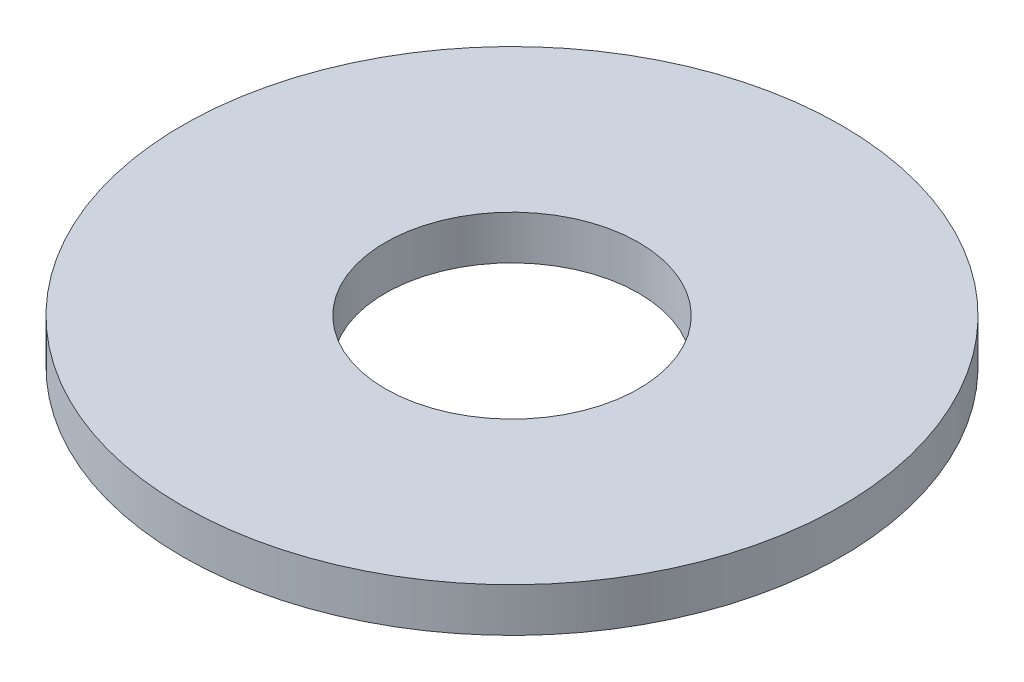
ISO-10303-21;
HEADER;
FILE_DESCRIPTION(('STEP AP214'),'2;1');
FILE_NAME('part.step','',(''),(''),'','','');
FILE_SCHEMA(('AUTOMOTIVE_DESIGN { 1 0 10303 214 1 1 1 1 }'));
ENDSEC;
DATA;
#1=APPLICATION_CONTEXT('core data for automotive mechanical design processes');
#2=APPLICATION_PROTOCOL_DEFINITION('international standard','automotive_design',2000,#1);
#3=PRODUCT_CONTEXT('',#1,'mechanical');
#4=PRODUCT('Part','Part','',(#3));
#5=PRODUCT_RELATED_PRODUCT_CATEGORY('part','',(#4));
#6=PRODUCT_DEFINITION_FORMATION('','',#4);
#7=PRODUCT_DEFINITION_CONTEXT('part definition',#1,'design');
#8=PRODUCT_DEFINITION('design','',#6,#7);
#9=PRODUCT_DEFINITION_SHAPE('','',#8);
#10=(LENGTH_UNIT() NAMED_UNIT(*) SI_UNIT(.MILLI.,.METRE.));
#11=(NAMED_UNIT(*) PLANE_ANGLE_UNIT() SI_UNIT($,.RADIAN.));
#12=(NAMED_UNIT(*) SI_UNIT($,.STERADIAN.) SOLID_ANGLE_UNIT());
#13=UNCERTAINTY_MEASURE_WITH_UNIT(LENGTH_MEASURE(1.E-05),#10,'distance_accuracy_value','');
#14=(GEOMETRIC_REPRESENTATION_CONTEXT(3) GLOBAL_UNCERTAINTY_ASSIGNED_CONTEXT((#13)) GLOBAL_UNIT_ASSIGNED_CONTEXT((#10,
#11,#12)) REPRESENTATION_CONTEXT('',''));
#15=CARTESIAN_POINT('',(0.,0.,0.));
#16=DIRECTION('',(0.,0.,1.));
#17=DIRECTION('',(1.,0.,0.));
#18=AXIS2_PLACEMENT_3D('',#15,#16,#17);
#19=CARTESIAN_POINT('',(0.,13.,0.));
#20=DIRECTION('',(0.,-1.,0.));
#21=DIRECTION('',(0.,0.,-1.));
#22=AXIS2_PLACEMENT_3D('',#19,#20,#21);
#23=CYLINDRICAL_SURFACE('',#22,97.5);
#24=CARTESIAN_POINT('',(0.,13.,0.));
#25=DIRECTION('',(0.,1.,0.));
#26=DIRECTION('',(0.,0.,1.));
#27=AXIS2_PLACEMENT_3D('',#24,#25,#26);
#28=CIRCLE('',#27,97.5);
#29=CARTESIAN_POINT('',(0.,13.,-97.5));
#30=VERTEX_POINT('',#29);
#31=EDGE_CURVE('E10',#30,#30,#28,.T.);
#32=CARTESIAN_POINT('',(0.,0.,0.));
#33=DIRECTION('',(0.,1.,0.));
#34=DIRECTION('',(0.,0.,1.));
#35=AXIS2_PLACEMENT_3D('',#32,#33,#34);
#36=CIRCLE('',#35,97.5);
#37=CARTESIAN_POINT('',(0.,0.,-97.5));
#38=VERTEX_POINT('',#37);
#39=EDGE_CURVE('E37',#38,#38,#36,.T.);
#40=CARTESIAN_POINT('',(0.,13.,-97.5));
#41=CARTESIAN_POINT('',(0.,12.8645833333333,-97.5));
#42=CARTESIAN_POINT('',(0.,12.7291666666667,-97.5));
#43=CARTESIAN_POINT('',(0.,12.4583333333333,-97.5));
#44=CARTESIAN_POINT('',(0.,12.3229166666667,-97.5));
#45=CARTESIAN_POINT('',(0.,12.0520833333333,-97.5));
#46=CARTESIAN_POINT('',(0.,11.9166666666667,-97.5));
#47=CARTESIAN_POINT('',(0.,11.6458333333333,-97.5));
#48=CARTESIAN_POINT('',(0.,11.5104166666667,-97.5));
#49=CARTESIAN_POINT('',(0.,11.2395833333333,-97.5));
#50=CARTESIAN_POINT('',(0.,11.1041666666667,-97.5));
#51=CARTESIAN_POINT('',(0.,10.8333333333333,-97.5));
#52=CARTESIAN_POINT('',(0.,10.6979166666667,-97.5));
#53=CARTESIAN_POINT('',(0.,10.4270833333333,-97.5));
#54=CARTESIAN_POINT('',(0.,10.2916666666667,-97.5));
#55=CARTESIAN_POINT('',(0.,10.0208333333333,-97.5));
#56=CARTESIAN_POINT('',(0.,9.88541666666667,-97.5));
#57=CARTESIAN_POINT('',(0.,9.61458333333333,-97.5));
#58=CARTESIAN_POINT('',(0.,9.47916666666667,-97.5));
#59=CARTESIAN_POINT('',(0.,9.20833333333333,-97.5));
#60=CARTESIAN_POINT('',(0.,9.07291666666667,-97.5));
#61=CARTESIAN_POINT('',(0.,8.80208333333333,-97.5));
#62=CARTESIAN_POINT('',(0.,8.66666666666667,-97.5));
#63=CARTESIAN_POINT('',(0.,8.39583333333333,-97.5));
#64=CARTESIAN_POINT('',(0.,8.26041666666667,-97.5));
#65=CARTESIAN_POINT('',(0.,7.98958333333333,-97.5));
#66=CARTESIAN_POINT('',(0.,7.85416666666667,-97.5));
#67=CARTESIAN_POINT('',(0.,7.58333333333333,-97.5));
#68=CARTESIAN_POINT('',(0.,7.44791666666667,-97.5));
#69=CARTESIAN_POINT('',(0.,7.17708333333333,-97.5));
#70=CARTESIAN_POINT('',(0.,7.04166666666667,-97.5));
#71=CARTESIAN_POINT('',(0.,6.77083333333333,-97.5));
#72=CARTESIAN_POINT('',(0.,6.63541666666667,-97.5));
#73=CARTESIAN_POINT('',(0.,6.36458333333333,-97.5));
#74=CARTESIAN_POINT('',(0.,6.22916666666667,-97.5));
#75=CARTESIAN_POINT('',(0.,5.95833333333333,-97.5));
#76=CARTESIAN_POINT('',(0.,5.82291666666667,-97.5));
#77=CARTESIAN_POINT('',(0.,5.55208333333333,-97.5));
#78=CARTESIAN_POINT('',(0.,5.41666666666667,-97.5));
#79=CARTESIAN_POINT('',(0.,5.14583333333333,-97.5));
#80=CARTESIAN_POINT('',(0.,5.01041666666667,-97.5));
#81=CARTESIAN_POINT('',(0.,4.73958333333333,-97.5));
#82=CARTESIAN_POINT('',(0.,4.60416666666667,-97.5));
#83=CARTESIAN_POINT('',(0.,4.33333333333333,-97.5));
#84=CARTESIAN_POINT('',(0.,4.19791666666667,-97.5));
#85=CARTESIAN_POINT('',(0.,3.92708333333333,-97.5));
#86=CARTESIAN_POINT('',(0.,3.79166666666667,-97.5));
#87=CARTESIAN_POINT('',(0.,3.52083333333333,-97.5));
#88=CARTESIAN_POINT('',(0.,3.38541666666667,-97.5));
#89=CARTESIAN_POINT('',(0.,3.11458333333333,-97.5));
#90=CARTESIAN_POINT('',(0.,2.97916666666667,-97.5));
#91=CARTESIAN_POINT('',(0.,2.70833333333333,-97.5));
#92=CARTESIAN_POINT('',(0.,2.57291666666667,-97.5));
#93=CARTESIAN_POINT('',(0.,2.30208333333333,-97.5));
#94=CARTESIAN_POINT('',(0.,2.16666666666667,-97.5));
#95=CARTESIAN_POINT('',(0.,1.89583333333333,-97.5));
#96=CARTESIAN_POINT('',(0.,1.76041666666667,-97.5));
#97=CARTESIAN_POINT('',(0.,1.48958333333333,-97.5));
#98=CARTESIAN_POINT('',(0.,1.35416666666667,-97.5));
#99=CARTESIAN_POINT('',(0.,1.08333333333333,-97.5));
#100=CARTESIAN_POINT('',(0.,0.947916666666667,-97.5));
#101=CARTESIAN_POINT('',(0.,0.677083333333334,-97.5));
#102=CARTESIAN_POINT('',(0.,0.541666666666667,-97.5));
#103=CARTESIAN_POINT('',(0.,0.270833333333334,-97.5));
#104=CARTESIAN_POINT('',(0.,0.135416666666667,-97.5));
#105=CARTESIAN_POINT('',(0.,0.,-97.5));
#106=B_SPLINE_CURVE_WITH_KNOTS('',3,(#40,#41,#42,#43,#44,#45,#46,#47,#48,#49,#50,#51,#52,#53,
#54,#55,#56,#57,#58,#59,#60,#61,#62,#63,#64,#65,#66,#67,#68,#69,#70,#71,#72,#73,#74,#75,#76,#77,
#78,#79,#80,#81,#82,#83,#84,#85,#86,#87,#88,#89,#90,#91,#92,#93,#94,#95,#96,#97,#98,#99,#100,
#101,#102,#103,#104,#105),.UNSPECIFIED.,.F.,.F.,(4,2,2,2,2,2,2,2,2,2,2,2,2,2,2,2,2,2,2,2,2,2,2,
2,2,2,2,2,2,2,2,2,4),(0.,0.406249999999999,0.812499999999999,1.21875,1.625,2.03125,2.4375,
2.84375,3.25,3.65625,4.0625,4.46875,4.875,5.28125,5.6875,6.09375,6.5,6.90625,7.3125,7.71875,
8.125,8.53125,8.9375,9.34375,9.75,10.15625,10.5625,10.96875,11.375,11.78125,12.1875,12.59375,
13.),.UNSPECIFIED.);
#107=EDGE_CURVE('BSEAM40',#30,#38,#106,.T.);
#108=ORIENTED_EDGE('',*,*,#31,.F.);
#109=ORIENTED_EDGE('',*,*,#39,.T.);
#110=ORIENTED_EDGE('',*,*,#107,.T.);
#111=ORIENTED_EDGE('',*,*,#107,.F.);
#112=EDGE_LOOP('',(#108,#110,#109,#111));
#113=FACE_BOUND('',#112,.T.);
#114=ADVANCED_FACE('F40',(#113),#23,.T.);
#115=CARTESIAN_POINT('',(0.,13.,0.));
#116=DIRECTION('',(0.,1.,0.));
#117=DIRECTION('',(0.,0.,1.));
#118=AXIS2_PLACEMENT_3D('',#115,#116,#117);
#119=PLANE('',#118);
#120=CARTESIAN_POINT('',(0.,13.,0.));
#121=DIRECTION('',(0.,1.,0.));
#122=DIRECTION('',(0.,0.,1.));
#123=AXIS2_PLACEMENT_3D('',#120,#121,#122);
#124=CIRCLE('',#123,37.5);
#125=CARTESIAN_POINT('',(0.,13.,-37.5));
#126=VERTEX_POINT('',#125);
#127=EDGE_CURVE('E50',#126,#126,#124,.T.);
#128=ORIENTED_EDGE('',*,*,#127,.F.);
#129=EDGE_LOOP('',(#128));
#130=FACE_BOUND('',#129,.T.);
#131=ORIENTED_EDGE('',*,*,#31,.T.);
#132=EDGE_LOOP('',(#131));
#133=FACE_BOUND('',#132,.T.);
#134=ADVANCED_FACE('F59',(#130,#133),#119,.T.);
#135=CARTESIAN_POINT('',(0.,0.,0.));
#136=DIRECTION('',(0.,1.,0.));
#137=DIRECTION('',(0.,0.,1.));
#138=AXIS2_PLACEMENT_3D('',#135,#136,#137);
#139=PLANE('',#138);
#140=CARTESIAN_POINT('',(0.,0.,0.));
#141=DIRECTION('',(0.,1.,0.));
#142=DIRECTION('',(0.,0.,1.));
#143=AXIS2_PLACEMENT_3D('',#140,#141,#142);
#144=CIRCLE('',#143,37.5);
#145=CARTESIAN_POINT('',(0.,0.,-37.5));
#146=VERTEX_POINT('',#145);
#147=EDGE_CURVE('E47',#146,#146,#144,.T.);
#148=ORIENTED_EDGE('',*,*,#147,.T.);
#149=EDGE_LOOP('',(#148));
#150=FACE_BOUND('',#149,.T.);
#151=ORIENTED_EDGE('',*,*,#39,.F.);
#152=EDGE_LOOP('',(#151));
#153=FACE_BOUND('',#152,.T.);
#154=ADVANCED_FACE('F58',(#150,#153),#139,.F.);
#155=CARTESIAN_POINT('',(0.,13.,0.));
#156=DIRECTION('',(0.,-1.,0.));
#157=DIRECTION('',(0.,0.,-1.));
#158=AXIS2_PLACEMENT_3D('',#155,#156,#157);
#159=CYLINDRICAL_SURFACE('',#158,37.5);
#160=CARTESIAN_POINT('',(0.,13.,-37.5));
#161=CARTESIAN_POINT('',(0.,12.8645833333333,-37.5));
#162=CARTESIAN_POINT('',(0.,12.7291666666667,-37.5));
#163=CARTESIAN_POINT('',(0.,12.4583333333333,-37.5));
#164=CARTESIAN_POINT('',(0.,12.3229166666667,-37.5));
#165=CARTESIAN_POINT('',(0.,12.0520833333333,-37.5));
#166=CARTESIAN_POINT('',(0.,11.9166666666667,-37.5));
#167=CARTESIAN_POINT('',(0.,11.6458333333333,-37.5));
#168=CARTESIAN_POINT('',(0.,11.5104166666667,-37.5));
#169=CARTESIAN_POINT('',(0.,11.2395833333333,-37.5));
#170=CARTESIAN_POINT('',(0.,11.1041666666667,-37.5));
#171=CARTESIAN_POINT('',(0.,10.8333333333333,-37.5));
#172=CARTESIAN_POINT('',(0.,10.6979166666667,-37.5));
#173=CARTESIAN_POINT('',(0.,10.4270833333333,-37.5));
#174=CARTESIAN_POINT('',(0.,10.2916666666667,-37.5));
#175=CARTESIAN_POINT('',(0.,10.0208333333333,-37.5));
#176=CARTESIAN_POINT('',(0.,9.88541666666667,-37.5));
#177=CARTESIAN_POINT('',(0.,9.61458333333333,-37.5));
#178=CARTESIAN_POINT('',(0.,9.47916666666667,-37.5));
#179=CARTESIAN_POINT('',(0.,9.20833333333333,-37.5));
#180=CARTESIAN_POINT('',(0.,9.07291666666666,-37.5));
#181=CARTESIAN_POINT('',(0.,8.80208333333333,-37.5));
#182=CARTESIAN_POINT('',(0.,8.66666666666667,-37.5));
#183=CARTESIAN_POINT('',(0.,8.39583333333333,-37.5));
#184=CARTESIAN_POINT('',(0.,8.26041666666667,-37.5));
#185=CARTESIAN_POINT('',(0.,7.98958333333333,-37.5));
#186=CARTESIAN_POINT('',(0.,7.85416666666667,-37.5));
#187=CARTESIAN_POINT('',(0.,7.58333333333333,-37.5));
#188=CARTESIAN_POINT('',(0.,7.44791666666667,-37.5));
#189=CARTESIAN_POINT('',(0.,7.17708333333333,-37.5));
#190=CARTESIAN_POINT('',(0.,7.04166666666667,-37.5));
#191=CARTESIAN_POINT('',(0.,6.77083333333333,-37.5));
#192=CARTESIAN_POINT('',(0.,6.63541666666667,-37.5));
#193=CARTESIAN_POINT('',(0.,6.36458333333333,-37.5));
#194=CARTESIAN_POINT('',(0.,6.22916666666667,-37.5));
#195=CARTESIAN_POINT('',(0.,5.95833333333333,-37.5));
#196=CARTESIAN_POINT('',(0.,5.82291666666667,-37.5));
#197=CARTESIAN_POINT('',(0.,5.55208333333333,-37.5));
#198=CARTESIAN_POINT('',(0.,5.41666666666667,-37.5));
#199=CARTESIAN_POINT('',(0.,5.14583333333333,-37.5));
#200=CARTESIAN_POINT('',(0.,5.01041666666667,-37.5));
#201=CARTESIAN_POINT('',(0.,4.73958333333333,-37.5));
#202=CARTESIAN_POINT('',(0.,4.60416666666667,-37.5));
#203=CARTESIAN_POINT('',(0.,4.33333333333333,-37.5));
#204=CARTESIAN_POINT('',(0.,4.19791666666667,-37.5));
#205=CARTESIAN_POINT('',(0.,3.92708333333333,-37.5));
#206=CARTESIAN_POINT('',(0.,3.79166666666667,-37.5));
#207=CARTESIAN_POINT('',(0.,3.52083333333333,-37.5));
#208=CARTESIAN_POINT('',(0.,3.38541666666667,-37.5));
#209=CARTESIAN_POINT('',(0.,3.11458333333333,-37.5));
#210=CARTESIAN_POINT('',(0.,2.97916666666667,-37.5));
#211=CARTESIAN_POINT('',(0.,2.70833333333333,-37.5));
#212=CARTESIAN_POINT('',(0.,2.57291666666667,-37.5));
#213=CARTESIAN_POINT('',(0.,2.30208333333333,-37.5));
#214=CARTESIAN_POINT('',(0.,2.16666666666667,-37.5));
#215=CARTESIAN_POINT('',(0.,1.89583333333333,-37.5));
#216=CARTESIAN_POINT('',(0.,1.76041666666667,-37.5));
#217=CARTESIAN_POINT('',(0.,1.48958333333333,-37.5));
#218=CARTESIAN_POINT('',(0.,1.35416666666667,-37.5));
#219=CARTESIAN_POINT('',(0.,1.08333333333333,-37.5));
#220=CARTESIAN_POINT('',(0.,0.947916666666667,-37.5));
#221=CARTESIAN_POINT('',(0.,0.677083333333334,-37.5));
#222=CARTESIAN_POINT('',(0.,0.541666666666667,-37.5));
#223=CARTESIAN_POINT('',(0.,0.270833333333334,-37.5));
#224=CARTESIAN_POINT('',(0.,0.135416666666667,-37.5));
#225=CARTESIAN_POINT('',(0.,0.,-37.5));
#226=B_SPLINE_CURVE_WITH_KNOTS('',3,(#160,#161,#162,#163,#164,#165,#166,#167,#168,#169,#170,
#171,#172,#173,#174,#175,#176,#177,#178,#179,#180,#181,#182,#183,#184,#185,#186,#187,#188,#189,
#190,#191,#192,#193,#194,#195,#196,#197,#198,#199,#200,#201,#202,#203,#204,#205,#206,#207,#208,
#209,#210,#211,#212,#213,#214,#215,#216,#217,#218,#219,#220,#221,#222,#223,#224,#225),
.UNSPECIFIED.,.F.,.F.,(4,2,2,2,2,2,2,2,2,2,2,2,2,2,2,2,2,2,2,2,2,2,2,2,2,2,2,2,2,2,2,2,4),(0.,
0.40625,0.812500000000001,1.21875,1.625,2.03125,2.4375,2.84375,3.25,3.65625,4.0625,4.46875,
4.875,5.28125,5.6875,6.09375,6.5,6.90625,7.3125,7.71875,8.125,8.53125,8.9375,9.34375,9.75,
10.15625,10.5625,10.96875,11.375,11.78125,12.1875,12.59375,13.),.UNSPECIFIED.);
#227=EDGE_CURVE('BSEAM54',#126,#146,#226,.T.);
#228=ORIENTED_EDGE('',*,*,#127,.T.);
#229=ORIENTED_EDGE('',*,*,#147,.F.);
#230=ORIENTED_EDGE('',*,*,#227,.T.);
#231=ORIENTED_EDGE('',*,*,#227,.F.);
#232=EDGE_LOOP('',(#228,#230,#229,#231));
#233=FACE_BOUND('',#232,.T.);
#234=ADVANCED_FACE('F54',(#233),#159,.F.);
#235=CLOSED_SHELL('',(#114,#134,#154,#234));
#236=MANIFOLD_SOLID_BREP('B2',#235);
#237=ADVANCED_BREP_SHAPE_REPRESENTATION('',(#18,#236),#14);
#238=SHAPE_DEFINITION_REPRESENTATION(#9,#237);
ENDSEC;
END-ISO-10303-21;
